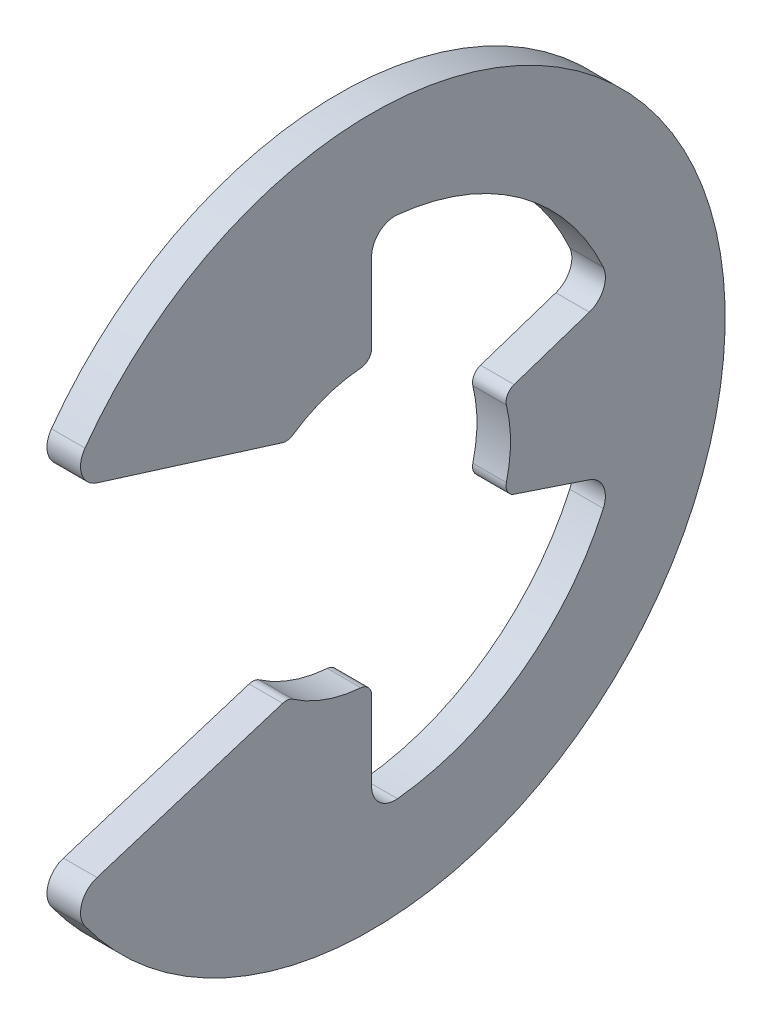
ISO-10303-21;
HEADER;
FILE_DESCRIPTION(('STEP AP214'),'2;1');
FILE_NAME('part.step','',(''),(''),'','','');
FILE_SCHEMA(('AUTOMOTIVE_DESIGN { 1 0 10303 214 1 1 1 1 }'));
ENDSEC;
DATA;
#1=APPLICATION_CONTEXT('core data for automotive mechanical design processes');
#2=APPLICATION_PROTOCOL_DEFINITION('international standard','automotive_design',2000,#1);
#3=PRODUCT_CONTEXT('',#1,'mechanical');
#4=PRODUCT('Part','Part','',(#3));
#5=PRODUCT_RELATED_PRODUCT_CATEGORY('part','',(#4));
#6=PRODUCT_DEFINITION_FORMATION('','',#4);
#7=PRODUCT_DEFINITION_CONTEXT('part definition',#1,'design');
#8=PRODUCT_DEFINITION('design','',#6,#7);
#9=PRODUCT_DEFINITION_SHAPE('','',#8);
#10=(LENGTH_UNIT() NAMED_UNIT(*) SI_UNIT(.MILLI.,.METRE.));
#11=(NAMED_UNIT(*) PLANE_ANGLE_UNIT() SI_UNIT($,.RADIAN.));
#12=(NAMED_UNIT(*) SI_UNIT($,.STERADIAN.) SOLID_ANGLE_UNIT());
#13=UNCERTAINTY_MEASURE_WITH_UNIT(LENGTH_MEASURE(1.E-05),#10,'distance_accuracy_value','');
#14=(GEOMETRIC_REPRESENTATION_CONTEXT(3) GLOBAL_UNCERTAINTY_ASSIGNED_CONTEXT((#13)) GLOBAL_UNIT_ASSIGNED_CONTEXT((#10,
#11,#12)) REPRESENTATION_CONTEXT('',''));
#15=CARTESIAN_POINT('',(0.,0.,0.));
#16=DIRECTION('',(0.,0.,1.));
#17=DIRECTION('',(1.,0.,0.));
#18=AXIS2_PLACEMENT_3D('',#15,#16,#17);
#19=CARTESIAN_POINT('',(0.3175,0.,0.));
#20=DIRECTION('',(-1.,0.,0.));
#21=DIRECTION('',(0.,0.,1.));
#22=AXIS2_PLACEMENT_3D('',#19,#20,#21);
#23=CYLINDRICAL_SURFACE('',#22,2.6289);
#24=CARTESIAN_POINT('',(0.3175,0.,0.));
#25=DIRECTION('',(-1.,0.,0.));
#26=DIRECTION('',(0.,0.,-1.));
#27=AXIS2_PLACEMENT_3D('',#24,#25,#26);
#28=CIRCLE('',#27,2.6289);
#29=CARTESIAN_POINT('',(0.3175,0.634392297731757,-2.55120787521884));
#30=VERTEX_POINT('',#29);
#31=CARTESIAN_POINT('',(0.3175,-0.634392297731756,-2.55120787521884));
#32=VERTEX_POINT('',#31);
#33=EDGE_CURVE('E262',#30,#32,#28,.T.);
#34=ORIENTED_EDGE('',*,*,#33,.F.);
#35=DIRECTION('',(-1.,0.,0.));
#36=VECTOR('',#35,1.);
#37=CARTESIAN_POINT('',(0.3175,0.634392297731757,-2.55120787521884));
#38=LINE('',#37,#36);
#39=CARTESIAN_POINT('',(-0.3175,0.634392297731757,-2.55120787521884));
#40=VERTEX_POINT('',#39);
#41=EDGE_CURVE('E427',#30,#40,#38,.T.);
#42=ORIENTED_EDGE('',*,*,#41,.T.);
#43=CARTESIAN_POINT('',(-0.3175,0.,0.));
#44=DIRECTION('',(-1.,0.,0.));
#45=DIRECTION('',(0.,0.,-1.));
#46=AXIS2_PLACEMENT_3D('',#43,#44,#45);
#47=CIRCLE('',#46,2.6289);
#48=CARTESIAN_POINT('',(-0.3175,-0.634392297731756,-2.55120787521884));
#49=VERTEX_POINT('',#48);
#50=EDGE_CURVE('E492',#40,#49,#47,.T.);
#51=ORIENTED_EDGE('',*,*,#50,.T.);
#52=DIRECTION('',(-1.,0.,0.));
#53=VECTOR('',#52,1.);
#54=CARTESIAN_POINT('',(0.3175,-0.634392297731757,-2.55120787521884));
#55=LINE('',#54,#53);
#56=EDGE_CURVE('E67',#49,#32,#55,.F.);
#57=ORIENTED_EDGE('',*,*,#56,.T.);
#58=EDGE_LOOP('',(#34,#42,#51,#57));
#59=FACE_BOUND('',#58,.T.);
#60=ADVANCED_FACE('F43',(#59),#23,.F.);
#61=CARTESIAN_POINT('',(0.3175,-0.831331174081665,-2.493993522245));
#62=DIRECTION('',(0.,0.948683298050514,-0.316227766016838));
#63=DIRECTION('',(0.,0.316227766016838,0.948683298050514));
#64=AXIS2_PLACEMENT_3D('',#61,#62,#63);
#65=PLANE('',#64);
#66=DIRECTION('',(0.,-0.316227766016838,-0.948683298050514));
#67=VECTOR('',#66,1.);
#68=CARTESIAN_POINT('',(0.3175,-0.831331174081665,-2.493993522245));
#69=LINE('',#68,#67);
#70=CARTESIAN_POINT('',(0.3175,-0.898869359807086,-2.69660807942126));
#71=VERTEX_POINT('',#70);
#72=CARTESIAN_POINT('',(0.3175,-1.37371537804572,-4.12114613413716));
#73=VERTEX_POINT('',#72);
#74=EDGE_CURVE('E265',#71,#73,#69,.T.);
#75=ORIENTED_EDGE('',*,*,#74,.F.);
#76=DIRECTION('',(-1.,0.,0.));
#77=VECTOR('',#76,1.);
#78=CARTESIAN_POINT('',(0.3175,-0.898869359807086,-2.69660807942126));
#79=LINE('',#78,#77);
#80=CARTESIAN_POINT('',(-0.3175,-0.898869359807086,-2.69660807942126));
#81=VERTEX_POINT('',#80);
#82=EDGE_CURVE('E434',#71,#81,#79,.T.);
#83=ORIENTED_EDGE('',*,*,#82,.T.);
#84=DIRECTION('',(0.,-0.316227766016838,-0.948683298050514));
#85=VECTOR('',#84,1.);
#86=CARTESIAN_POINT('',(-0.3175,-0.831331174081665,-2.493993522245));
#87=LINE('',#86,#85);
#88=CARTESIAN_POINT('',(-0.3175,-1.37371537804572,-4.12114613413716));
#89=VERTEX_POINT('',#88);
#90=EDGE_CURVE('E495',#81,#89,#87,.T.);
#91=ORIENTED_EDGE('',*,*,#90,.T.);
#92=DIRECTION('',(1.,0.,0.));
#93=VECTOR('',#92,1.);
#94=CARTESIAN_POINT('',(0.3175,-1.37371537804572,-4.12114613413716));
#95=LINE('',#94,#93);
#96=EDGE_CURVE('E331',#89,#73,#95,.T.);
#97=ORIENTED_EDGE('',*,*,#96,.T.);
#98=EDGE_LOOP('',(#75,#83,#91,#97));
#99=FACE_BOUND('',#98,.T.);
#100=ADVANCED_FACE('F535',(#99),#65,.F.);
#101=CARTESIAN_POINT('',(0.3175,0.,0.));
#102=DIRECTION('',(-1.,0.,0.));
#103=DIRECTION('',(0.,0.,1.));
#104=AXIS2_PLACEMENT_3D('',#101,#102,#103);
#105=CYLINDRICAL_SURFACE('',#104,4.81125161290323);
#106=CARTESIAN_POINT('',(-0.3175,0.,0.));
#107=DIRECTION('',(-1.,0.,0.));
#108=DIRECTION('',(0.,0.,-1.));
#109=AXIS2_PLACEMENT_3D('',#106,#107,#108);
#110=CIRCLE('',#109,4.81125161290323);
#111=CARTESIAN_POINT('',(-0.3175,-1.97816282406592,-4.38577403933986));
#112=VERTEX_POINT('',#111);
#113=CARTESIAN_POINT('',(-0.3175,-4.78626059081718,-0.489746505300684));
#114=VERTEX_POINT('',#113);
#115=EDGE_CURVE('E498',#112,#114,#110,.T.);
#116=ORIENTED_EDGE('',*,*,#115,.T.);
#117=DIRECTION('',(-1.,0.,0.));
#118=VECTOR('',#117,1.);
#119=CARTESIAN_POINT('',(0.3175,-4.78626059081718,-0.489746505300684));
#120=LINE('',#119,#118);
#121=CARTESIAN_POINT('',(0.3175,-4.78626059081718,-0.489746505300684));
#122=VERTEX_POINT('',#121);
#123=EDGE_CURVE('E328',#114,#122,#120,.F.);
#124=ORIENTED_EDGE('',*,*,#123,.T.);
#125=CARTESIAN_POINT('',(0.3175,0.,0.));
#126=DIRECTION('',(-1.,0.,0.));
#127=DIRECTION('',(0.,0.,-1.));
#128=AXIS2_PLACEMENT_3D('',#125,#126,#127);
#129=CIRCLE('',#128,4.81125161290323);
#130=CARTESIAN_POINT('',(0.3175,-1.97816282406592,-4.38577403933986));
#131=VERTEX_POINT('',#130);
#132=EDGE_CURVE('E268',#131,#122,#129,.T.);
#133=ORIENTED_EDGE('',*,*,#132,.F.);
#134=DIRECTION('',(-1.,0.,0.));
#135=VECTOR('',#134,1.);
#136=CARTESIAN_POINT('',(0.3175,-1.97816282406592,-4.38577403933986));
#137=LINE('',#136,#135);
#138=EDGE_CURVE('E324',#131,#112,#137,.T.);
#139=ORIENTED_EDGE('',*,*,#138,.T.);
#140=EDGE_LOOP('',(#116,#124,#133,#139));
#141=FACE_BOUND('',#140,.T.);
#142=ADVANCED_FACE('F541',(#141),#105,.F.);
#143=CARTESIAN_POINT('',(0.3175,-4.81125161290323,0.));
#144=DIRECTION('',(0.,0.,1.));
#145=DIRECTION('',(0.,-1.,0.));
#146=AXIS2_PLACEMENT_3D('',#143,#144,#145);
#147=PLANE('',#146);
#148=DIRECTION('',(0.,1.,0.));
#149=VECTOR('',#148,1.);
#150=CARTESIAN_POINT('',(-0.3175,-4.81125161290323,0.));
#151=LINE('',#150,#149);
#152=CARTESIAN_POINT('',(-0.3175,-4.34406945142374,0.));
#153=VERTEX_POINT('',#152);
#154=CARTESIAN_POINT('',(-0.3175,-2.8424744959278,0.));
#155=VERTEX_POINT('',#154);
#156=EDGE_CURVE('E504',#153,#155,#151,.T.);
#157=ORIENTED_EDGE('',*,*,#156,.T.);
#158=DIRECTION('',(-1.,0.,0.));
#159=VECTOR('',#158,1.);
#160=CARTESIAN_POINT('',(0.3175,-2.8424744959278,0.));
#161=LINE('',#160,#159);
#162=CARTESIAN_POINT('',(0.3175,-2.8424744959278,0.));
#163=VERTEX_POINT('',#162);
#164=EDGE_CURVE('E401',#155,#163,#161,.F.);
#165=ORIENTED_EDGE('',*,*,#164,.T.);
#166=DIRECTION('',(0.,1.,0.));
#167=VECTOR('',#166,1.);
#168=CARTESIAN_POINT('',(0.3175,-4.81125161290323,0.));
#169=LINE('',#168,#167);
#170=CARTESIAN_POINT('',(0.3175,-4.34406945142374,0.));
#171=VERTEX_POINT('',#170);
#172=EDGE_CURVE('E272',#171,#163,#169,.T.);
#173=ORIENTED_EDGE('',*,*,#172,.F.);
#174=DIRECTION('',(1.,0.,0.));
#175=VECTOR('',#174,1.);
#176=CARTESIAN_POINT('',(-0.3175,-4.34406945142374,0.));
#177=LINE('',#176,#175);
#178=EDGE_CURVE('E320',#171,#153,#177,.F.);
#179=ORIENTED_EDGE('',*,*,#178,.T.);
#180=EDGE_LOOP('',(#157,#165,#173,#179));
#181=FACE_BOUND('',#180,.T.);
#182=ADVANCED_FACE('F547',(#181),#147,.F.);
#183=CARTESIAN_POINT('',(0.3175,0.,0.));
#184=DIRECTION('',(-1.,0.,0.));
#185=DIRECTION('',(0.,0.,1.));
#186=AXIS2_PLACEMENT_3D('',#183,#184,#185);
#187=CYLINDRICAL_SURFACE('',#186,2.6289);
#188=CARTESIAN_POINT('',(0.3175,0.,0.));
#189=DIRECTION('',(-1.,0.,0.));
#190=DIRECTION('',(0.,0.,-1.));
#191=AXIS2_PLACEMENT_3D('',#188,#189,#190);
#192=CIRCLE('',#191,2.6289);
#193=CARTESIAN_POINT('',(0.3175,-2.62090076016505,0.204925389755011));
#194=VERTEX_POINT('',#193);
#195=CARTESIAN_POINT('',(0.3175,-2.16527043809185,1.490878646948));
#196=VERTEX_POINT('',#195);
#197=EDGE_CURVE('E276',#194,#196,#192,.T.);
#198=ORIENTED_EDGE('',*,*,#197,.F.);
#199=DIRECTION('',(-1.,0.,0.));
#200=VECTOR('',#199,1.);
#201=CARTESIAN_POINT('',(0.3175,-2.62090076016505,0.204925389755011));
#202=LINE('',#201,#200);
#203=CARTESIAN_POINT('',(-0.3175,-2.62090076016505,0.204925389755011));
#204=VERTEX_POINT('',#203);
#205=EDGE_CURVE('E379',#194,#204,#202,.T.);
#206=ORIENTED_EDGE('',*,*,#205,.T.);
#207=CARTESIAN_POINT('',(-0.3175,0.,0.));
#208=DIRECTION('',(-1.,0.,0.));
#209=DIRECTION('',(0.,0.,-1.));
#210=AXIS2_PLACEMENT_3D('',#207,#208,#209);
#211=CIRCLE('',#210,2.6289);
#212=CARTESIAN_POINT('',(-0.3175,-2.16527043809185,1.490878646948));
#213=VERTEX_POINT('',#212);
#214=EDGE_CURVE('E244',#204,#213,#211,.T.);
#215=ORIENTED_EDGE('',*,*,#214,.T.);
#216=DIRECTION('',(-1.,0.,0.));
#217=VECTOR('',#216,1.);
#218=CARTESIAN_POINT('',(0.3175,-2.16527043809185,1.490878646948));
#219=LINE('',#218,#217);
#220=EDGE_CURVE('E376',#213,#196,#219,.F.);
#221=ORIENTED_EDGE('',*,*,#220,.T.);
#222=EDGE_LOOP('',(#198,#206,#215,#221));
#223=FACE_BOUND('',#222,.T.);
#224=ADVANCED_FACE('F512',(#223),#187,.F.);
#225=CARTESIAN_POINT('',(0.3175,-2.10312,1.57734));
#226=DIRECTION('',(0.,-0.954513538836349,-0.29816757734219));
#227=DIRECTION('',(0.,0.29816757734219,-0.954513538836349));
#228=AXIS2_PLACEMENT_3D('',#225,#226,#227);
#229=PLANE('',#228);
#230=DIRECTION('',(0.,-0.29816757734219,0.954513538836348));
#231=VECTOR('',#230,1.);
#232=CARTESIAN_POINT('',(0.3175,-2.10312,1.57734));
#233=LINE('',#232,#231);
#234=CARTESIAN_POINT('',(0.3175,-2.13618406817537,1.683186856334));
#235=VERTEX_POINT('',#234);
#236=CARTESIAN_POINT('',(0.3175,-3.2341191064352,5.19796826926775));
#237=VERTEX_POINT('',#236);
#238=EDGE_CURVE('E280',#235,#237,#233,.T.);
#239=ORIENTED_EDGE('',*,*,#238,.F.);
#240=DIRECTION('',(-1.,0.,0.));
#241=VECTOR('',#240,1.);
#242=CARTESIAN_POINT('',(0.3175,-2.13618406817537,1.683186856334));
#243=LINE('',#242,#241);
#244=CARTESIAN_POINT('',(-0.3175,-2.13618406817537,1.683186856334));
#245=VERTEX_POINT('',#244);
#246=EDGE_CURVE('E421',#235,#245,#243,.T.);
#247=ORIENTED_EDGE('',*,*,#246,.T.);
#248=DIRECTION('',(0.,-0.29816757734219,0.954513538836348));
#249=VECTOR('',#248,1.);
#250=CARTESIAN_POINT('',(-0.3175,-2.10312,1.57734));
#251=LINE('',#250,#249);
#252=CARTESIAN_POINT('',(-0.3175,-3.2341191064352,5.19796826926775));
#253=VERTEX_POINT('',#252);
#254=EDGE_CURVE('E237',#245,#253,#251,.T.);
#255=ORIENTED_EDGE('',*,*,#254,.T.);
#256=DIRECTION('',(-1.,0.,0.));
#257=VECTOR('',#256,1.);
#258=CARTESIAN_POINT('',(0.3175,-3.2341191064352,5.19796826926775));
#259=LINE('',#258,#257);
#260=EDGE_CURVE('E214',#253,#237,#259,.F.);
#261=ORIENTED_EDGE('',*,*,#260,.T.);
#262=EDGE_LOOP('',(#239,#247,#255,#261));
#263=FACE_BOUND('',#262,.T.);
#264=ADVANCED_FACE('F520',(#263),#229,.F.);
#265=CARTESIAN_POINT('',(0.3175,0.,0.));
#266=DIRECTION('',(-1.,0.,0.));
#267=DIRECTION('',(0.,0.,1.));
#268=AXIS2_PLACEMENT_3D('',#265,#266,#267);
#269=CYLINDRICAL_SURFACE('',#268,6.6929);
#270=CARTESIAN_POINT('',(0.3175,0.,0.));
#271=DIRECTION('',(1.,0.,0.));
#272=DIRECTION('',(0.,0.,-1.));
#273=AXIS2_PLACEMENT_3D('',#270,#271,#272);
#274=CIRCLE('',#273,6.6929);
#275=CARTESIAN_POINT('',(0.3175,-3.91865243360584,5.42577860906571));
#276=VERTEX_POINT('',#275);
#277=CARTESIAN_POINT('',(0.3175,3.91865243360584,5.42577860906571));
#278=VERTEX_POINT('',#277);
#279=EDGE_CURVE('E228',#276,#278,#274,.T.);
#280=ORIENTED_EDGE('',*,*,#279,.F.);
#281=DIRECTION('',(-1.,0.,0.));
#282=VECTOR('',#281,1.);
#283=CARTESIAN_POINT('',(0.3175,-3.91865243360584,5.42577860906571));
#284=LINE('',#283,#282);
#285=CARTESIAN_POINT('',(-0.3175,-3.91865243360584,5.42577860906571));
#286=VERTEX_POINT('',#285);
#287=EDGE_CURVE('E212',#276,#286,#284,.T.);
#288=ORIENTED_EDGE('',*,*,#287,.T.);
#289=CARTESIAN_POINT('',(-0.3175,0.,0.));
#290=DIRECTION('',(1.,0.,0.));
#291=DIRECTION('',(0.,0.,-1.));
#292=AXIS2_PLACEMENT_3D('',#289,#290,#291);
#293=CIRCLE('',#292,6.6929);
#294=CARTESIAN_POINT('',(-0.3175,3.91865243360584,5.42577860906571));
#295=VERTEX_POINT('',#294);
#296=EDGE_CURVE('E225',#286,#295,#293,.T.);
#297=ORIENTED_EDGE('',*,*,#296,.T.);
#298=DIRECTION('',(-1.,0.,0.));
#299=VECTOR('',#298,1.);
#300=CARTESIAN_POINT('',(0.3175,3.91865243360584,5.42577860906571));
#301=LINE('',#300,#299);
#302=EDGE_CURVE('E230',#295,#278,#301,.F.);
#303=ORIENTED_EDGE('',*,*,#302,.T.);
#304=EDGE_LOOP('',(#280,#288,#297,#303));
#305=FACE_BOUND('',#304,.T.);
#306=ADVANCED_FACE('F224',(#305),#269,.T.);
#307=CARTESIAN_POINT('',(0.3175,3.40948689870738,5.75936710911388));
#308=DIRECTION('',(0.,0.954513538836349,-0.298167577342189));
#309=DIRECTION('',(0.,0.298167577342189,0.954513538836349));
#310=AXIS2_PLACEMENT_3D('',#307,#308,#309);
#311=PLANE('',#310);
#312=DIRECTION('',(0.,-0.298167577342189,-0.954513538836349));
#313=VECTOR('',#312,1.);
#314=CARTESIAN_POINT('',(-0.3175,3.40948689870738,5.75936710911388));
#315=LINE('',#314,#313);
#316=CARTESIAN_POINT('',(-0.3175,3.2341191064352,5.19796826926775));
#317=VERTEX_POINT('',#316);
#318=CARTESIAN_POINT('',(-0.3175,2.13618406817537,1.683186856334));
#319=VERTEX_POINT('',#318);
#320=EDGE_CURVE('E236',#317,#319,#315,.T.);
#321=ORIENTED_EDGE('',*,*,#320,.T.);
#322=DIRECTION('',(-1.,0.,0.));
#323=VECTOR('',#322,1.);
#324=CARTESIAN_POINT('',(0.3175,2.13618406817537,1.683186856334));
#325=LINE('',#324,#323);
#326=CARTESIAN_POINT('',(0.3175,2.13618406817537,1.683186856334));
#327=VERTEX_POINT('',#326);
#328=EDGE_CURVE('E52',#319,#327,#325,.F.);
#329=ORIENTED_EDGE('',*,*,#328,.T.);
#330=DIRECTION('',(0.,-0.298167577342189,-0.954513538836349));
#331=VECTOR('',#330,1.);
#332=CARTESIAN_POINT('',(0.3175,3.40948689870738,5.75936710911388));
#333=LINE('',#332,#331);
#334=CARTESIAN_POINT('',(0.3175,3.2341191064352,5.19796826926775));
#335=VERTEX_POINT('',#334);
#336=EDGE_CURVE('E285',#335,#327,#333,.T.);
#337=ORIENTED_EDGE('',*,*,#336,.F.);
#338=DIRECTION('',(-1.,0.,0.));
#339=VECTOR('',#338,1.);
#340=CARTESIAN_POINT('',(0.3175,3.2341191064352,5.19796826926775));
#341=LINE('',#340,#339);
#342=EDGE_CURVE('E316',#335,#317,#341,.T.);
#343=ORIENTED_EDGE('',*,*,#342,.T.);
#344=EDGE_LOOP('',(#321,#329,#337,#343));
#345=FACE_BOUND('',#344,.T.);
#346=ADVANCED_FACE('F448',(#345),#311,.F.);
#347=CARTESIAN_POINT('',(0.3175,0.,0.));
#348=DIRECTION('',(-1.,0.,0.));
#349=DIRECTION('',(0.,0.,1.));
#350=AXIS2_PLACEMENT_3D('',#347,#348,#349);
#351=CYLINDRICAL_SURFACE('',#350,2.6289);
#352=CARTESIAN_POINT('',(0.3175,0.,0.));
#353=DIRECTION('',(-1.,0.,0.));
#354=DIRECTION('',(0.,0.,-1.));
#355=AXIS2_PLACEMENT_3D('',#352,#353,#354);
#356=CIRCLE('',#355,2.6289);
#357=CARTESIAN_POINT('',(0.3175,2.16527043809185,1.49087864694801));
#358=VERTEX_POINT('',#357);
#359=CARTESIAN_POINT('',(0.3175,2.62090076016505,0.204925389755012));
#360=VERTEX_POINT('',#359);
#361=EDGE_CURVE('E289',#358,#360,#356,.T.);
#362=ORIENTED_EDGE('',*,*,#361,.F.);
#363=DIRECTION('',(-1.,0.,0.));
#364=VECTOR('',#363,1.);
#365=CARTESIAN_POINT('',(0.3175,2.16527043809185,1.49087864694801));
#366=LINE('',#365,#364);
#367=CARTESIAN_POINT('',(-0.3175,2.16527043809185,1.49087864694801));
#368=VERTEX_POINT('',#367);
#369=EDGE_CURVE('E441',#358,#368,#366,.T.);
#370=ORIENTED_EDGE('',*,*,#369,.T.);
#371=CARTESIAN_POINT('',(-0.3175,0.,0.));
#372=DIRECTION('',(-1.,0.,0.));
#373=DIRECTION('',(0.,0.,-1.));
#374=AXIS2_PLACEMENT_3D('',#371,#372,#373);
#375=CIRCLE('',#374,2.6289);
#376=CARTESIAN_POINT('',(-0.3175,2.62090076016505,0.204925389755012));
#377=VERTEX_POINT('',#376);
#378=EDGE_CURVE('E242',#368,#377,#375,.T.);
#379=ORIENTED_EDGE('',*,*,#378,.T.);
#380=DIRECTION('',(-1.,0.,0.));
#381=VECTOR('',#380,1.);
#382=CARTESIAN_POINT('',(0.3175,2.62090076016505,0.204925389755012));
#383=LINE('',#382,#381);
#384=EDGE_CURVE('E438',#377,#360,#383,.F.);
#385=ORIENTED_EDGE('',*,*,#384,.T.);
#386=EDGE_LOOP('',(#362,#370,#379,#385));
#387=FACE_BOUND('',#386,.T.);
#388=ADVANCED_FACE('F459',(#387),#351,.F.);
#389=CARTESIAN_POINT('',(0.3175,2.6289,0.));
#390=DIRECTION('',(0.,0.,1.));
#391=DIRECTION('',(0.,-1.,0.));
#392=AXIS2_PLACEMENT_3D('',#389,#390,#391);
#393=PLANE('',#392);
#394=DIRECTION('',(0.,1.,0.));
#395=VECTOR('',#394,1.);
#396=CARTESIAN_POINT('',(0.3175,2.6289,0.));
#397=LINE('',#396,#395);
#398=CARTESIAN_POINT('',(0.3175,2.8424744959278,0.));
#399=VERTEX_POINT('',#398);
#400=CARTESIAN_POINT('',(0.3175,4.34406945142374,0.));
#401=VERTEX_POINT('',#400);
#402=EDGE_CURVE('E293',#399,#401,#397,.T.);
#403=ORIENTED_EDGE('',*,*,#402,.F.);
#404=DIRECTION('',(-1.,0.,0.));
#405=VECTOR('',#404,1.);
#406=CARTESIAN_POINT('',(0.3175,2.8424744959278,0.));
#407=LINE('',#406,#405);
#408=CARTESIAN_POINT('',(-0.3175,2.8424744959278,0.));
#409=VERTEX_POINT('',#408);
#410=EDGE_CURVE('E11',#399,#409,#407,.T.);
#411=ORIENTED_EDGE('',*,*,#410,.T.);
#412=DIRECTION('',(0.,1.,0.));
#413=VECTOR('',#412,1.);
#414=CARTESIAN_POINT('',(-0.3175,2.6289,0.));
#415=LINE('',#414,#413);
#416=CARTESIAN_POINT('',(-0.3175,4.34406945142374,0.));
#417=VERTEX_POINT('',#416);
#418=EDGE_CURVE('E251',#409,#417,#415,.T.);
#419=ORIENTED_EDGE('',*,*,#418,.T.);
#420=DIRECTION('',(1.,0.,0.));
#421=VECTOR('',#420,1.);
#422=CARTESIAN_POINT('',(0.3175,4.34406945142374,0.));
#423=LINE('',#422,#421);
#424=EDGE_CURVE('E346',#417,#401,#423,.T.);
#425=ORIENTED_EDGE('',*,*,#424,.T.);
#426=EDGE_LOOP('',(#403,#411,#419,#425));
#427=FACE_BOUND('',#426,.T.);
#428=ADVANCED_FACE('F467',(#427),#393,.F.);
#429=CARTESIAN_POINT('',(0.3175,0.,0.));
#430=DIRECTION('',(-1.,0.,0.));
#431=DIRECTION('',(0.,0.,1.));
#432=AXIS2_PLACEMENT_3D('',#429,#430,#431);
#433=CYLINDRICAL_SURFACE('',#432,4.81125161290323);
#434=CARTESIAN_POINT('',(-0.3175,0.,0.));
#435=DIRECTION('',(-1.,0.,0.));
#436=DIRECTION('',(0.,0.,-1.));
#437=AXIS2_PLACEMENT_3D('',#434,#435,#436);
#438=CIRCLE('',#437,4.81125161290323);
#439=CARTESIAN_POINT('',(-0.3175,4.78626059081718,-0.489746505300684));
#440=VERTEX_POINT('',#439);
#441=CARTESIAN_POINT('',(-0.3175,1.97816282406592,-4.38577403933986));
#442=VERTEX_POINT('',#441);
#443=EDGE_CURVE('E254',#440,#442,#438,.T.);
#444=ORIENTED_EDGE('',*,*,#443,.T.);
#445=DIRECTION('',(-1.,0.,0.));
#446=VECTOR('',#445,1.);
#447=CARTESIAN_POINT('',(0.3175,1.97816282406592,-4.38577403933986));
#448=LINE('',#447,#446);
#449=CARTESIAN_POINT('',(0.3175,1.97816282406592,-4.38577403933986));
#450=VERTEX_POINT('',#449);
#451=EDGE_CURVE('E343',#442,#450,#448,.F.);
#452=ORIENTED_EDGE('',*,*,#451,.T.);
#453=CARTESIAN_POINT('',(0.3175,0.,0.));
#454=DIRECTION('',(-1.,0.,0.));
#455=DIRECTION('',(0.,0.,-1.));
#456=AXIS2_PLACEMENT_3D('',#453,#454,#455);
#457=CIRCLE('',#456,4.81125161290323);
#458=CARTESIAN_POINT('',(0.3175,4.78626059081718,-0.489746505300684));
#459=VERTEX_POINT('',#458);
#460=EDGE_CURVE('E296',#459,#450,#457,.T.);
#461=ORIENTED_EDGE('',*,*,#460,.F.);
#462=DIRECTION('',(-1.,0.,0.));
#463=VECTOR('',#462,1.);
#464=CARTESIAN_POINT('',(0.3175,4.78626059081718,-0.489746505300684));
#465=LINE('',#464,#463);
#466=EDGE_CURVE('E339',#459,#440,#465,.T.);
#467=ORIENTED_EDGE('',*,*,#466,.T.);
#468=EDGE_LOOP('',(#444,#452,#461,#467));
#469=FACE_BOUND('',#468,.T.);
#470=ADVANCED_FACE('F475',(#469),#433,.F.);
#471=CARTESIAN_POINT('',(0.3175,1.5214513492933,-4.56435404787989));
#472=DIRECTION('',(0.,-0.948683298050514,-0.316227766016838));
#473=DIRECTION('',(0.,0.316227766016838,-0.948683298050514));
#474=AXIS2_PLACEMENT_3D('',#471,#472,#473);
#475=PLANE('',#474);
#476=DIRECTION('',(0.,-0.316227766016838,0.948683298050514));
#477=VECTOR('',#476,1.);
#478=CARTESIAN_POINT('',(-0.3175,1.5214513492933,-4.56435404787989));
#479=LINE('',#478,#477);
#480=CARTESIAN_POINT('',(-0.3175,1.37371537804572,-4.12114613413716));
#481=VERTEX_POINT('',#480);
#482=CARTESIAN_POINT('',(-0.3175,0.898869359807086,-2.69660807942126));
#483=VERTEX_POINT('',#482);
#484=EDGE_CURVE('E258',#481,#483,#479,.T.);
#485=ORIENTED_EDGE('',*,*,#484,.T.);
#486=DIRECTION('',(-1.,0.,0.));
#487=VECTOR('',#486,1.);
#488=CARTESIAN_POINT('',(0.3175,0.898869359807086,-2.69660807942126));
#489=LINE('',#488,#487);
#490=CARTESIAN_POINT('',(0.3175,0.898869359807086,-2.69660807942126));
#491=VERTEX_POINT('',#490);
#492=EDGE_CURVE('E431',#483,#491,#489,.F.);
#493=ORIENTED_EDGE('',*,*,#492,.T.);
#494=DIRECTION('',(0.,-0.316227766016838,0.948683298050514));
#495=VECTOR('',#494,1.);
#496=CARTESIAN_POINT('',(0.3175,1.5214513492933,-4.56435404787989));
#497=LINE('',#496,#495);
#498=CARTESIAN_POINT('',(0.3175,1.37371537804572,-4.12114613413716));
#499=VERTEX_POINT('',#498);
#500=EDGE_CURVE('E300',#499,#491,#497,.T.);
#501=ORIENTED_EDGE('',*,*,#500,.F.);
#502=DIRECTION('',(1.,0.,0.));
#503=VECTOR('',#502,1.);
#504=CARTESIAN_POINT('',(-0.3175,1.37371537804572,-4.12114613413716));
#505=LINE('',#504,#503);
#506=EDGE_CURVE('E335',#499,#481,#505,.F.);
#507=ORIENTED_EDGE('',*,*,#506,.T.);
#508=EDGE_LOOP('',(#485,#493,#501,#507));
#509=FACE_BOUND('',#508,.T.);
#510=ADVANCED_FACE('F486',(#509),#475,.F.);
#511=CARTESIAN_POINT('',(0.3175,0.,0.));
#512=DIRECTION('',(1.,0.,0.));
#513=DIRECTION('',(0.,0.,-1.));
#514=AXIS2_PLACEMENT_3D('',#511,#512,#513);
#515=PLANE('',#514);
#516=ORIENTED_EDGE('',*,*,#172,.T.);
#517=CARTESIAN_POINT('',(0.3175,-2.8424744959278,0.22225));
#518=DIRECTION('',(1.,0.,0.));
#519=DIRECTION('',(0.,0.,-1.));
#520=AXIS2_PLACEMENT_3D('',#517,#518,#519);
#521=CIRCLE('',#520,0.22225);
#522=EDGE_CURVE('E418',#163,#194,#521,.T.);
#523=ORIENTED_EDGE('',*,*,#522,.T.);
#524=ORIENTED_EDGE('',*,*,#197,.T.);
#525=CARTESIAN_POINT('',(0.3175,-2.34832470218174,1.6169191122697));
#526=DIRECTION('',(1.,0.,0.));
#527=DIRECTION('',(0.,0.,-1.));
#528=AXIS2_PLACEMENT_3D('',#525,#526,#527);
#529=CIRCLE('',#528,0.22225);
#530=EDGE_CURVE('E415',#196,#235,#529,.T.);
#531=ORIENTED_EDGE('',*,*,#530,.T.);
#532=ORIENTED_EDGE('',*,*,#238,.T.);
#533=CARTESIAN_POINT('',(0.3175,-3.65840037444796,5.06543278113915));
#534=DIRECTION('',(1.,0.,0.));
#535=DIRECTION('',(0.,0.,-1.));
#536=AXIS2_PLACEMENT_3D('',#533,#534,#535);
#537=CIRCLE('',#536,0.4445);
#538=EDGE_CURVE('E313',#237,#276,#537,.T.);
#539=ORIENTED_EDGE('',*,*,#538,.T.);
#540=ORIENTED_EDGE('',*,*,#279,.T.);
#541=CARTESIAN_POINT('',(0.3175,3.65840037444795,5.06543278113915));
#542=DIRECTION('',(1.,0.,0.));
#543=DIRECTION('',(0.,0.,-1.));
#544=AXIS2_PLACEMENT_3D('',#541,#542,#543);
#545=CIRCLE('',#544,0.4445);
#546=EDGE_CURVE('E310',#278,#335,#545,.T.);
#547=ORIENTED_EDGE('',*,*,#546,.T.);
#548=ORIENTED_EDGE('',*,*,#336,.T.);
#549=CARTESIAN_POINT('',(0.3175,2.34832470218174,1.6169191122697));
#550=DIRECTION('',(1.,0.,0.));
#551=DIRECTION('',(0.,0.,-1.));
#552=AXIS2_PLACEMENT_3D('',#549,#550,#551);
#553=CIRCLE('',#552,0.22225);
#554=EDGE_CURVE('E407',#327,#358,#553,.T.);
#555=ORIENTED_EDGE('',*,*,#554,.T.);
#556=ORIENTED_EDGE('',*,*,#361,.T.);
#557=CARTESIAN_POINT('',(0.3175,2.8424744959278,0.222250000000001));
#558=DIRECTION('',(1.,0.,0.));
#559=DIRECTION('',(0.,0.,-1.));
#560=AXIS2_PLACEMENT_3D('',#557,#558,#559);
#561=CIRCLE('',#560,0.22225);
#562=EDGE_CURVE('E404',#360,#399,#561,.T.);
#563=ORIENTED_EDGE('',*,*,#562,.T.);
#564=ORIENTED_EDGE('',*,*,#402,.T.);
#565=CARTESIAN_POINT('',(0.3175,4.34406945142374,-0.444499999999999));
#566=DIRECTION('',(1.,0.,0.));
#567=DIRECTION('',(0.,0.,-1.));
#568=AXIS2_PLACEMENT_3D('',#565,#566,#567);
#569=CIRCLE('',#568,0.4445);
#570=EDGE_CURVE('E373',#401,#459,#569,.F.);
#571=ORIENTED_EDGE('',*,*,#570,.T.);
#572=ORIENTED_EDGE('',*,*,#460,.T.);
#573=CARTESIAN_POINT('',(0.3175,1.79540510402917,-3.98058289214267));
#574=DIRECTION('',(1.,0.,0.));
#575=DIRECTION('',(0.,0.,-1.));
#576=AXIS2_PLACEMENT_3D('',#573,#574,#575);
#577=CIRCLE('',#576,0.4445);
#578=EDGE_CURVE('E366',#450,#499,#577,.F.);
#579=ORIENTED_EDGE('',*,*,#578,.T.);
#580=ORIENTED_EDGE('',*,*,#500,.T.);
#581=CARTESIAN_POINT('',(0.3175,0.68802449681536,-2.7668897004185));
#582=DIRECTION('',(1.,0.,0.));
#583=DIRECTION('',(0.,0.,-1.));
#584=AXIS2_PLACEMENT_3D('',#581,#582,#583);
#585=CIRCLE('',#584,0.22225);
#586=EDGE_CURVE('E412',#491,#30,#585,.T.);
#587=ORIENTED_EDGE('',*,*,#586,.T.);
#588=ORIENTED_EDGE('',*,*,#33,.T.);
#589=CARTESIAN_POINT('',(0.3175,-0.688024496815359,-2.7668897004185));
#590=DIRECTION('',(1.,0.,0.));
#591=DIRECTION('',(0.,0.,-1.));
#592=AXIS2_PLACEMENT_3D('',#589,#590,#591);
#593=CIRCLE('',#592,0.22225);
#594=EDGE_CURVE('E59',#32,#71,#593,.T.);
#595=ORIENTED_EDGE('',*,*,#594,.T.);
#596=ORIENTED_EDGE('',*,*,#74,.T.);
#597=CARTESIAN_POINT('',(0.3175,-1.79540510402917,-3.98058289214267));
#598=DIRECTION('',(1.,0.,0.));
#599=DIRECTION('',(0.,0.,-1.));
#600=AXIS2_PLACEMENT_3D('',#597,#598,#599);
#601=CIRCLE('',#600,0.4445);
#602=EDGE_CURVE('E360',#73,#131,#601,.F.);
#603=ORIENTED_EDGE('',*,*,#602,.T.);
#604=ORIENTED_EDGE('',*,*,#132,.T.);
#605=CARTESIAN_POINT('',(0.3175,-4.34406945142374,-0.444499999999999));
#606=DIRECTION('',(1.,0.,0.));
#607=DIRECTION('',(0.,0.,-1.));
#608=AXIS2_PLACEMENT_3D('',#605,#606,#607);
#609=CIRCLE('',#608,0.4445);
#610=EDGE_CURVE('E353',#122,#171,#609,.F.);
#611=ORIENTED_EDGE('',*,*,#610,.T.);
#612=EDGE_LOOP('',(#516,#523,#524,#531,#532,#539,#540,#547,#548,#555,#556,#563,#564,#571,#572,
#579,#580,#587,#588,#595,#596,#603,#604,#611));
#613=FACE_BOUND('',#612,.T.);
#614=ADVANCED_FACE('F452',(#613),#515,.T.);
#615=CARTESIAN_POINT('',(-0.3175,0.,0.));
#616=DIRECTION('',(1.,0.,0.));
#617=DIRECTION('',(0.,0.,-1.));
#618=AXIS2_PLACEMENT_3D('',#615,#616,#617);
#619=PLANE('',#618);
#620=ORIENTED_EDGE('',*,*,#214,.F.);
#621=CARTESIAN_POINT('',(-0.3175,-2.8424744959278,0.22225));
#622=DIRECTION('',(1.,0.,0.));
#623=DIRECTION('',(0.,0.,-1.));
#624=AXIS2_PLACEMENT_3D('',#621,#622,#623);
#625=CIRCLE('',#624,0.22225);
#626=EDGE_CURVE('E398',#204,#155,#625,.F.);
#627=ORIENTED_EDGE('',*,*,#626,.T.);
#628=ORIENTED_EDGE('',*,*,#156,.F.);
#629=CARTESIAN_POINT('',(-0.3175,-4.34406945142374,-0.444499999999999));
#630=DIRECTION('',(1.,0.,0.));
#631=DIRECTION('',(0.,0.,-1.));
#632=AXIS2_PLACEMENT_3D('',#629,#630,#631);
#633=CIRCLE('',#632,0.4445);
#634=EDGE_CURVE('E350',#153,#114,#633,.T.);
#635=ORIENTED_EDGE('',*,*,#634,.T.);
#636=ORIENTED_EDGE('',*,*,#115,.F.);
#637=CARTESIAN_POINT('',(-0.3175,-1.79540510402917,-3.98058289214267));
#638=DIRECTION('',(1.,0.,0.));
#639=DIRECTION('',(0.,0.,-1.));
#640=AXIS2_PLACEMENT_3D('',#637,#638,#639);
#641=CIRCLE('',#640,0.4445);
#642=EDGE_CURVE('E356',#112,#89,#641,.T.);
#643=ORIENTED_EDGE('',*,*,#642,.T.);
#644=ORIENTED_EDGE('',*,*,#90,.F.);
#645=CARTESIAN_POINT('',(-0.3175,-0.688024496815359,-2.7668897004185));
#646=DIRECTION('',(1.,0.,0.));
#647=DIRECTION('',(0.,0.,-1.));
#648=AXIS2_PLACEMENT_3D('',#645,#646,#647);
#649=CIRCLE('',#648,0.22225);
#650=EDGE_CURVE('E389',#81,#49,#649,.F.);
#651=ORIENTED_EDGE('',*,*,#650,.T.);
#652=ORIENTED_EDGE('',*,*,#50,.F.);
#653=CARTESIAN_POINT('',(-0.3175,0.68802449681536,-2.7668897004185));
#654=DIRECTION('',(1.,0.,0.));
#655=DIRECTION('',(0.,0.,-1.));
#656=AXIS2_PLACEMENT_3D('',#653,#654,#655);
#657=CIRCLE('',#656,0.22225);
#658=EDGE_CURVE('E392',#40,#483,#657,.F.);
#659=ORIENTED_EDGE('',*,*,#658,.T.);
#660=ORIENTED_EDGE('',*,*,#484,.F.);
#661=CARTESIAN_POINT('',(-0.3175,1.79540510402917,-3.98058289214267));
#662=DIRECTION('',(1.,0.,0.));
#663=DIRECTION('',(0.,0.,-1.));
#664=AXIS2_PLACEMENT_3D('',#661,#662,#663);
#665=CIRCLE('',#664,0.4445);
#666=EDGE_CURVE('E363',#481,#442,#665,.T.);
#667=ORIENTED_EDGE('',*,*,#666,.T.);
#668=ORIENTED_EDGE('',*,*,#443,.F.);
#669=CARTESIAN_POINT('',(-0.3175,4.34406945142374,-0.444499999999999));
#670=DIRECTION('',(1.,0.,0.));
#671=DIRECTION('',(0.,0.,-1.));
#672=AXIS2_PLACEMENT_3D('',#669,#670,#671);
#673=CIRCLE('',#672,0.4445);
#674=EDGE_CURVE('E369',#440,#417,#673,.T.);
#675=ORIENTED_EDGE('',*,*,#674,.T.);
#676=ORIENTED_EDGE('',*,*,#418,.F.);
#677=CARTESIAN_POINT('',(-0.3175,2.8424744959278,0.222250000000001));
#678=DIRECTION('',(1.,0.,0.));
#679=DIRECTION('',(0.,0.,-1.));
#680=AXIS2_PLACEMENT_3D('',#677,#678,#679);
#681=CIRCLE('',#680,0.22225);
#682=EDGE_CURVE('E383',#409,#377,#681,.F.);
#683=ORIENTED_EDGE('',*,*,#682,.T.);
#684=ORIENTED_EDGE('',*,*,#378,.F.);
#685=CARTESIAN_POINT('',(-0.3175,2.34832470218174,1.6169191122697));
#686=DIRECTION('',(1.,0.,0.));
#687=DIRECTION('',(0.,0.,-1.));
#688=AXIS2_PLACEMENT_3D('',#685,#686,#687);
#689=CIRCLE('',#688,0.22225);
#690=EDGE_CURVE('E386',#368,#319,#689,.F.);
#691=ORIENTED_EDGE('',*,*,#690,.T.);
#692=ORIENTED_EDGE('',*,*,#320,.F.);
#693=CARTESIAN_POINT('',(-0.3175,3.65840037444795,5.06543278113915));
#694=DIRECTION('',(1.,0.,0.));
#695=DIRECTION('',(0.,0.,-1.));
#696=AXIS2_PLACEMENT_3D('',#693,#694,#695);
#697=CIRCLE('',#696,0.4445);
#698=EDGE_CURVE('E219',#317,#295,#697,.F.);
#699=ORIENTED_EDGE('',*,*,#698,.T.);
#700=ORIENTED_EDGE('',*,*,#296,.F.);
#701=CARTESIAN_POINT('',(-0.3175,-3.65840037444796,5.06543278113915));
#702=DIRECTION('',(1.,0.,0.));
#703=DIRECTION('',(0.,0.,-1.));
#704=AXIS2_PLACEMENT_3D('',#701,#702,#703);
#705=CIRCLE('',#704,0.4445);
#706=EDGE_CURVE('E208',#286,#253,#705,.F.);
#707=ORIENTED_EDGE('',*,*,#706,.T.);
#708=ORIENTED_EDGE('',*,*,#254,.F.);
#709=CARTESIAN_POINT('',(-0.3175,-2.34832470218174,1.6169191122697));
#710=DIRECTION('',(1.,0.,0.));
#711=DIRECTION('',(0.,0.,-1.));
#712=AXIS2_PLACEMENT_3D('',#709,#710,#711);
#713=CIRCLE('',#712,0.22225);
#714=EDGE_CURVE('E395',#245,#213,#713,.F.);
#715=ORIENTED_EDGE('',*,*,#714,.T.);
#716=EDGE_LOOP('',(#620,#627,#628,#635,#636,#643,#644,#651,#652,#659,#660,#667,#668,#675,#676,
#683,#684,#691,#692,#699,#700,#707,#708,#715));
#717=FACE_BOUND('',#716,.T.);
#718=ADVANCED_FACE('F233',(#717),#619,.F.);
#719=CARTESIAN_POINT('',(0.3175,-3.65840037444796,5.06543278113915));
#720=DIRECTION('',(-1.,0.,0.));
#721=DIRECTION('',(0.,0.,1.));
#722=AXIS2_PLACEMENT_3D('',#719,#720,#721);
#723=CYLINDRICAL_SURFACE('',#722,0.4445);
#724=ORIENTED_EDGE('',*,*,#538,.F.);
#725=ORIENTED_EDGE('',*,*,#260,.F.);
#726=ORIENTED_EDGE('',*,*,#706,.F.);
#727=ORIENTED_EDGE('',*,*,#287,.F.);
#728=EDGE_LOOP('',(#724,#725,#726,#727));
#729=FACE_BOUND('',#728,.T.);
#730=ADVANCED_FACE('F211',(#729),#723,.T.);
#731=CARTESIAN_POINT('',(0.3175,3.65840037444795,5.06543278113915));
#732=DIRECTION('',(-1.,0.,0.));
#733=DIRECTION('',(0.,0.,1.));
#734=AXIS2_PLACEMENT_3D('',#731,#732,#733);
#735=CYLINDRICAL_SURFACE('',#734,0.4445);
#736=ORIENTED_EDGE('',*,*,#546,.F.);
#737=ORIENTED_EDGE('',*,*,#302,.F.);
#738=ORIENTED_EDGE('',*,*,#698,.F.);
#739=ORIENTED_EDGE('',*,*,#342,.F.);
#740=EDGE_LOOP('',(#736,#737,#738,#739));
#741=FACE_BOUND('',#740,.T.);
#742=ADVANCED_FACE('F522',(#741),#735,.T.);
#743=CARTESIAN_POINT('',(0.3175,-4.34406945142374,-0.444499999999999));
#744=DIRECTION('',(-1.,0.,0.));
#745=DIRECTION('',(0.,0.,1.));
#746=AXIS2_PLACEMENT_3D('',#743,#744,#745);
#747=CYLINDRICAL_SURFACE('',#746,0.4445);
#748=ORIENTED_EDGE('',*,*,#610,.F.);
#749=ORIENTED_EDGE('',*,*,#123,.F.);
#750=ORIENTED_EDGE('',*,*,#634,.F.);
#751=ORIENTED_EDGE('',*,*,#178,.F.);
#752=EDGE_LOOP('',(#748,#749,#750,#751));
#753=FACE_BOUND('',#752,.T.);
#754=ADVANCED_FACE('F524',(#753),#747,.F.);
#755=CARTESIAN_POINT('',(0.3175,-1.79540510402917,-3.98058289214267));
#756=DIRECTION('',(-1.,0.,0.));
#757=DIRECTION('',(0.,0.,1.));
#758=AXIS2_PLACEMENT_3D('',#755,#756,#757);
#759=CYLINDRICAL_SURFACE('',#758,0.4445);
#760=ORIENTED_EDGE('',*,*,#602,.F.);
#761=ORIENTED_EDGE('',*,*,#96,.F.);
#762=ORIENTED_EDGE('',*,*,#642,.F.);
#763=ORIENTED_EDGE('',*,*,#138,.F.);
#764=EDGE_LOOP('',(#760,#761,#762,#763));
#765=FACE_BOUND('',#764,.T.);
#766=ADVANCED_FACE('F530',(#765),#759,.F.);
#767=CARTESIAN_POINT('',(0.3175,1.79540510402917,-3.98058289214267));
#768=DIRECTION('',(-1.,0.,0.));
#769=DIRECTION('',(0.,0.,1.));
#770=AXIS2_PLACEMENT_3D('',#767,#768,#769);
#771=CYLINDRICAL_SURFACE('',#770,0.4445);
#772=ORIENTED_EDGE('',*,*,#578,.F.);
#773=ORIENTED_EDGE('',*,*,#451,.F.);
#774=ORIENTED_EDGE('',*,*,#666,.F.);
#775=ORIENTED_EDGE('',*,*,#506,.F.);
#776=EDGE_LOOP('',(#772,#773,#774,#775));
#777=FACE_BOUND('',#776,.T.);
#778=ADVANCED_FACE('F481',(#777),#771,.F.);
#779=CARTESIAN_POINT('',(0.3175,4.34406945142374,-0.444499999999999));
#780=DIRECTION('',(-1.,0.,0.));
#781=DIRECTION('',(0.,0.,1.));
#782=AXIS2_PLACEMENT_3D('',#779,#780,#781);
#783=CYLINDRICAL_SURFACE('',#782,0.4445);
#784=ORIENTED_EDGE('',*,*,#570,.F.);
#785=ORIENTED_EDGE('',*,*,#424,.F.);
#786=ORIENTED_EDGE('',*,*,#674,.F.);
#787=ORIENTED_EDGE('',*,*,#466,.F.);
#788=EDGE_LOOP('',(#784,#785,#786,#787));
#789=FACE_BOUND('',#788,.T.);
#790=ADVANCED_FACE('F478',(#789),#783,.F.);
#791=CARTESIAN_POINT('',(0.3175,-2.8424744959278,0.22225));
#792=DIRECTION('',(-1.,0.,0.));
#793=DIRECTION('',(0.,0.,1.));
#794=AXIS2_PLACEMENT_3D('',#791,#792,#793);
#795=CYLINDRICAL_SURFACE('',#794,0.22225);
#796=ORIENTED_EDGE('',*,*,#522,.F.);
#797=ORIENTED_EDGE('',*,*,#164,.F.);
#798=ORIENTED_EDGE('',*,*,#626,.F.);
#799=ORIENTED_EDGE('',*,*,#205,.F.);
#800=EDGE_LOOP('',(#796,#797,#798,#799));
#801=FACE_BOUND('',#800,.T.);
#802=ADVANCED_FACE('F579',(#801),#795,.T.);
#803=CARTESIAN_POINT('',(0.3175,-2.34832470218174,1.6169191122697));
#804=DIRECTION('',(-1.,0.,0.));
#805=DIRECTION('',(0.,0.,1.));
#806=AXIS2_PLACEMENT_3D('',#803,#804,#805);
#807=CYLINDRICAL_SURFACE('',#806,0.22225);
#808=ORIENTED_EDGE('',*,*,#530,.F.);
#809=ORIENTED_EDGE('',*,*,#220,.F.);
#810=ORIENTED_EDGE('',*,*,#714,.F.);
#811=ORIENTED_EDGE('',*,*,#246,.F.);
#812=EDGE_LOOP('',(#808,#809,#810,#811));
#813=FACE_BOUND('',#812,.T.);
#814=ADVANCED_FACE('F516',(#813),#807,.T.);
#815=CARTESIAN_POINT('',(0.3175,0.68802449681536,-2.7668897004185));
#816=DIRECTION('',(-1.,0.,0.));
#817=DIRECTION('',(0.,0.,1.));
#818=AXIS2_PLACEMENT_3D('',#815,#816,#817);
#819=CYLINDRICAL_SURFACE('',#818,0.22225);
#820=ORIENTED_EDGE('',*,*,#586,.F.);
#821=ORIENTED_EDGE('',*,*,#492,.F.);
#822=ORIENTED_EDGE('',*,*,#658,.F.);
#823=ORIENTED_EDGE('',*,*,#41,.F.);
#824=EDGE_LOOP('',(#820,#821,#822,#823));
#825=FACE_BOUND('',#824,.T.);
#826=ADVANCED_FACE('F489',(#825),#819,.T.);
#827=CARTESIAN_POINT('',(0.3175,-0.688024496815359,-2.7668897004185));
#828=DIRECTION('',(-1.,0.,0.));
#829=DIRECTION('',(0.,0.,1.));
#830=AXIS2_PLACEMENT_3D('',#827,#828,#829);
#831=CYLINDRICAL_SURFACE('',#830,0.22225);
#832=ORIENTED_EDGE('',*,*,#594,.F.);
#833=ORIENTED_EDGE('',*,*,#56,.F.);
#834=ORIENTED_EDGE('',*,*,#650,.F.);
#835=ORIENTED_EDGE('',*,*,#82,.F.);
#836=EDGE_LOOP('',(#832,#833,#834,#835));
#837=FACE_BOUND('',#836,.T.);
#838=ADVANCED_FACE('F597',(#837),#831,.T.);
#839=CARTESIAN_POINT('',(0.3175,2.34832470218174,1.6169191122697));
#840=DIRECTION('',(-1.,0.,0.));
#841=DIRECTION('',(0.,0.,1.));
#842=AXIS2_PLACEMENT_3D('',#839,#840,#841);
#843=CYLINDRICAL_SURFACE('',#842,0.22225);
#844=ORIENTED_EDGE('',*,*,#554,.F.);
#845=ORIENTED_EDGE('',*,*,#328,.F.);
#846=ORIENTED_EDGE('',*,*,#690,.F.);
#847=ORIENTED_EDGE('',*,*,#369,.F.);
#848=EDGE_LOOP('',(#844,#845,#846,#847));
#849=FACE_BOUND('',#848,.T.);
#850=ADVANCED_FACE('F456',(#849),#843,.T.);
#851=CARTESIAN_POINT('',(0.3175,2.8424744959278,0.222250000000001));
#852=DIRECTION('',(-1.,0.,0.));
#853=DIRECTION('',(0.,0.,1.));
#854=AXIS2_PLACEMENT_3D('',#851,#852,#853);
#855=CYLINDRICAL_SURFACE('',#854,0.22225);
#856=ORIENTED_EDGE('',*,*,#562,.F.);
#857=ORIENTED_EDGE('',*,*,#384,.F.);
#858=ORIENTED_EDGE('',*,*,#682,.F.);
#859=ORIENTED_EDGE('',*,*,#410,.F.);
#860=EDGE_LOOP('',(#856,#857,#858,#859));
#861=FACE_BOUND('',#860,.T.);
#862=ADVANCED_FACE('F45',(#861),#855,.T.);
#863=CLOSED_SHELL('',(#60,#100,#142,#182,#224,#264,#306,#346,#388,#428,#470,#510,#614,#718,#730,
#742,#754,#766,#778,#790,#802,#814,#826,#838,#850,#862));
#864=MANIFOLD_SOLID_BREP('B2',#863);
#865=ADVANCED_BREP_SHAPE_REPRESENTATION('',(#18,#864),#14);
#866=SHAPE_DEFINITION_REPRESENTATION(#9,#865);
ENDSEC;
END-ISO-10303-21;
